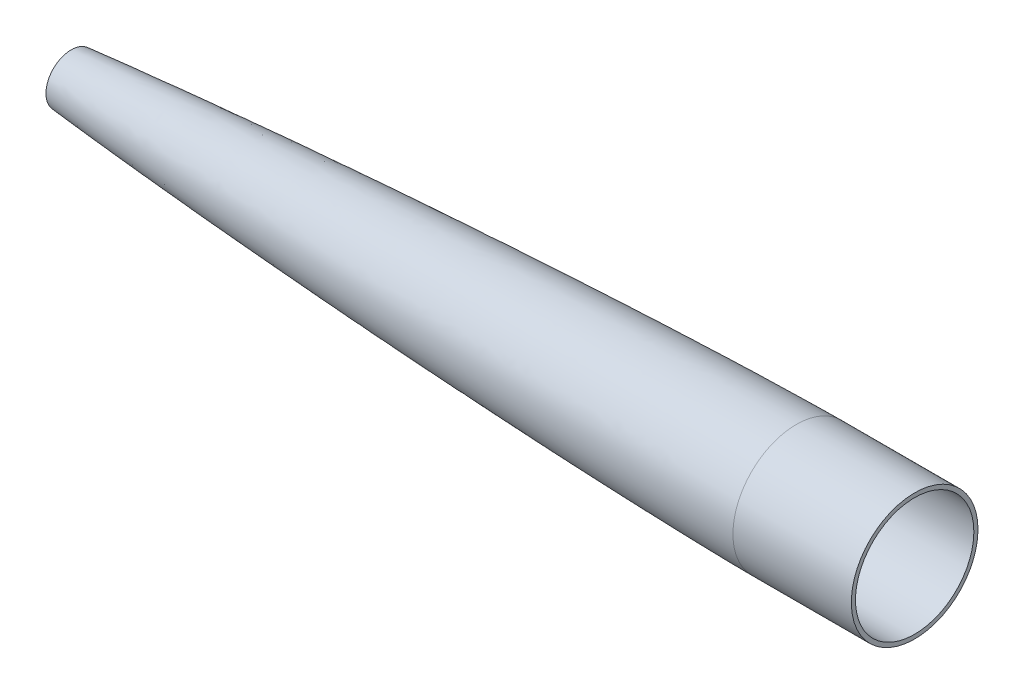
ISO-10303-21;
HEADER;
FILE_DESCRIPTION(('STEP AP214'),'2;1');
FILE_NAME('part.step','',(''),(''),'','','');
FILE_SCHEMA(('AUTOMOTIVE_DESIGN { 1 0 10303 214 1 1 1 1 }'));
ENDSEC;
DATA;
#1=APPLICATION_CONTEXT('core data for automotive mechanical design processes');
#2=APPLICATION_PROTOCOL_DEFINITION('international standard','automotive_design',2000,#1);
#3=PRODUCT_CONTEXT('',#1,'mechanical');
#4=PRODUCT('Part','Part','',(#3));
#5=PRODUCT_RELATED_PRODUCT_CATEGORY('part','',(#4));
#6=PRODUCT_DEFINITION_FORMATION('','',#4);
#7=PRODUCT_DEFINITION_CONTEXT('part definition',#1,'design');
#8=PRODUCT_DEFINITION('design','',#6,#7);
#9=PRODUCT_DEFINITION_SHAPE('','',#8);
#10=(LENGTH_UNIT() NAMED_UNIT(*) SI_UNIT(.MILLI.,.METRE.));
#11=(NAMED_UNIT(*) PLANE_ANGLE_UNIT() SI_UNIT($,.RADIAN.));
#12=(NAMED_UNIT(*) SI_UNIT($,.STERADIAN.) SOLID_ANGLE_UNIT());
#13=UNCERTAINTY_MEASURE_WITH_UNIT(LENGTH_MEASURE(1.E-05),#10,'distance_accuracy_value','');
#14=(GEOMETRIC_REPRESENTATION_CONTEXT(3) GLOBAL_UNCERTAINTY_ASSIGNED_CONTEXT((#13)) GLOBAL_UNIT_ASSIGNED_CONTEXT((#10,
#11,#12)) REPRESENTATION_CONTEXT('',''));
#15=CARTESIAN_POINT('',(0.,0.,0.));
#16=DIRECTION('',(0.,0.,1.));
#17=DIRECTION('',(1.,0.,0.));
#18=AXIS2_PLACEMENT_3D('',#15,#16,#17);
#19=CARTESIAN_POINT('',(69.85,0.,0.));
#20=DIRECTION('',(1.,0.,0.));
#21=DIRECTION('',(0.,0.,-1.));
#22=AXIS2_PLACEMENT_3D('',#19,#20,#21);
#23=PLANE('',#22);
#24=CARTESIAN_POINT('',(69.85,0.,0.));
#25=DIRECTION('',(1.,0.,0.));
#26=DIRECTION('',(0.,0.,-1.));
#27=AXIS2_PLACEMENT_3D('',#24,#25,#26);
#28=CIRCLE('',#27,10.790091691027);
#29=CARTESIAN_POINT('',(69.85,0.,-10.790091691027));
#30=VERTEX_POINT('',#29);
#31=EDGE_CURVE('E44',#30,#30,#28,.F.);
#32=ORIENTED_EDGE('',*,*,#31,.T.);
#33=EDGE_LOOP('',(#32));
#34=FACE_BOUND('',#33,.T.);
#35=CARTESIAN_POINT('',(69.85,0.,0.));
#36=DIRECTION('',(1.,0.,0.));
#37=DIRECTION('',(0.,0.,-1.));
#38=AXIS2_PLACEMENT_3D('',#35,#36,#37);
#39=CIRCLE('',#38,9.00448554056386);
#40=CARTESIAN_POINT('',(69.85,0.,-9.00448554056386));
#41=VERTEX_POINT('',#40);
#42=EDGE_CURVE('E10',#41,#41,#39,.T.);
#43=ORIENTED_EDGE('',*,*,#42,.T.);
#44=EDGE_LOOP('',(#43));
#45=FACE_BOUND('',#44,.T.);
#46=ADVANCED_FACE('F41',(#34,#45),#23,.F.);
#47=CARTESIAN_POINT('',(431.8,27.178,0.));
#48=DIRECTION('',(1.,0.,0.));
#49=DIRECTION('',(0.,0.,-1.));
#50=AXIS2_PLACEMENT_3D('',#47,#48,#49);
#51=PLANE('',#50);
#52=CARTESIAN_POINT('',(431.8,0.,0.));
#53=DIRECTION('',(1.,0.,0.));
#54=DIRECTION('',(0.,0.,-1.));
#55=AXIS2_PLACEMENT_3D('',#52,#53,#54);
#56=CIRCLE('',#55,27.178);
#57=CARTESIAN_POINT('',(431.8,0.,-27.178));
#58=VERTEX_POINT('',#57);
#59=EDGE_CURVE('E62',#58,#58,#56,.T.);
#60=ORIENTED_EDGE('',*,*,#59,.T.);
#61=EDGE_LOOP('',(#60));
#62=FACE_BOUND('',#61,.T.);
#63=CARTESIAN_POINT('',(431.8,0.,0.));
#64=DIRECTION('',(1.,0.,0.));
#65=DIRECTION('',(0.,0.,-1.));
#66=AXIS2_PLACEMENT_3D('',#63,#64,#65);
#67=CIRCLE('',#66,25.4);
#68=CARTESIAN_POINT('',(431.8,0.,-25.4));
#69=VERTEX_POINT('',#68);
#70=EDGE_CURVE('E58',#69,#69,#67,.T.);
#71=ORIENTED_EDGE('',*,*,#70,.F.);
#72=EDGE_LOOP('',(#71));
#73=FACE_BOUND('',#72,.T.);
#74=ADVANCED_FACE('F99',(#62,#73),#51,.T.);
#75=CARTESIAN_POINT('',(0.,0.,0.));
#76=DIRECTION('',(1.,0.,0.));
#77=DIRECTION('',(0.,0.,-1.));
#78=AXIS2_PLACEMENT_3D('',#75,#76,#77);
#79=CYLINDRICAL_SURFACE('',#78,25.3999999999994);
#80=ORIENTED_EDGE('',*,*,#70,.T.);
#81=EDGE_LOOP('',(#80));
#82=FACE_BOUND('',#81,.T.);
#83=CARTESIAN_POINT('',(381.,0.,0.));
#84=DIRECTION('',(1.,0.,0.));
#85=DIRECTION('',(0.,0.,-1.));
#86=AXIS2_PLACEMENT_3D('',#83,#84,#85);
#87=CIRCLE('',#86,25.3999999999988);
#88=CARTESIAN_POINT('',(381.,0.,-25.3999999999988));
#89=VERTEX_POINT('',#88);
#90=EDGE_CURVE('E53',#89,#89,#87,.T.);
#91=ORIENTED_EDGE('',*,*,#90,.F.);
#92=EDGE_LOOP('',(#91));
#93=FACE_BOUND('',#92,.T.);
#94=ADVANCED_FACE('F85',(#82,#93),#79,.F.);
#95=CARTESIAN_POINT('',(0.,0.,0.));
#96=CARTESIAN_POINT('',(0.00194131898105818,0.00324382281850564,0.));
#97=CARTESIAN_POINT('',(0.00638281843150003,0.00925201999437129,0.));
#98=CARTESIAN_POINT('',(0.0176672752625426,0.0192233607682896,0.));
#99=CARTESIAN_POINT('',(0.0422478322445727,0.0364888910073664,0.));
#100=CARTESIAN_POINT('',(0.0778590566848216,0.0572991083297123,0.));
#101=CARTESIAN_POINT('',(0.124666911094848,0.0810733879238252,0.));
#102=CARTESIAN_POINT('',(0.191190014980627,0.11156045619024,0.));
#103=CARTESIAN_POINT('',(0.270954305926508,0.144743138211191,0.));
#104=CARTESIAN_POINT('',(0.391141945765483,0.190791694328903,0.));
#105=CARTESIAN_POINT('',(0.570606758990353,0.253268093039603,0.));
#106=CARTESIAN_POINT('',(0.832648692772347,0.33633941228013,0.));
#107=CARTESIAN_POINT('',(1.26014846589056,0.459216901555793,0.));
#108=CARTESIAN_POINT('',(1.98312673069684,0.646181325770254,0.));
#109=CARTESIAN_POINT('',(3.28077516887983,0.943940875502552,0.));
#110=CARTESIAN_POINT('',(5.70508086499063,1.4307397776682,0.));
#111=CARTESIAN_POINT('',(10.2742825737692,2.22323289581667,0.));
#112=CARTESIAN_POINT('',(18.4903077036349,3.44274483447275,0.));
#113=CARTESIAN_POINT('',(31.8400399259184,5.13749675406155,0.));
#114=CARTESIAN_POINT('',(49.7469427778201,7.09950102046166,0.));
#115=CARTESIAN_POINT('',(71.1097711250029,9.16784910899345,0.));
#116=CARTESIAN_POINT('',(94.2685783470617,11.1850610547893,0.));
#117=CARTESIAN_POINT('',(117.441592145373,13.0306324072501,0.));
#118=CARTESIAN_POINT('',(140.625521947097,14.7330956752361,0.));
#119=CARTESIAN_POINT('',(163.818284683025,16.3102193474966,0.));
#120=CARTESIAN_POINT('',(187.01853645188,17.7729018299655,0.));
#121=CARTESIAN_POINT('',(210.225327067841,19.1276941212975,0.));
#122=CARTESIAN_POINT('',(239.241159915056,20.6903457255613,0.));
#123=CARTESIAN_POINT('',(268.265978315361,22.0787165522422,0.));
#124=CARTESIAN_POINT('',(297.298940403729,23.2863452136982,0.));
#125=CARTESIAN_POINT('',(326.339718466285,24.2852703157084,0.));
#126=CARTESIAN_POINT('',(346.242146301039,24.8430907377871,0.));
#127=CARTESIAN_POINT('',(362.8124479343,25.1993234300695,0.));
#128=CARTESIAN_POINT('',(373.573868338556,25.3501374288494,0.));
#129=CARTESIAN_POINT('',(378.5245713548,25.3941892108048,0.));
#130=CARTESIAN_POINT('',(381.,25.3999999999988,0.));
#131=B_SPLINE_CURVE_WITH_KNOTS('',4,(#95,#96,#97,#98,#99,#100,#101,#102,#103,#104,#105,#106,
#107,#108,#109,#110,#111,#112,#113,#114,#115,#116,#117,#118,#119,#120,#121,#122,#123,#124,#125,
#126,#127,#128,#129,#130),.UNSPECIFIED.,.F.,.F.,(5,1,1,1,1,1,1,1,1,1,1,1,1,1,1,1,1,1,1,1,1,1,1,
1,1,1,1,1,1,1,1,1,5),(0.,3.92274418332109E-05,7.84548836664218E-05,0.000156909767332844,
0.000313819534665687,0.000470729301998531,0.000627639069331374,0.000922762203045887,
0.0012178853367604,0.00181774938133708,0.0026163714155737,0.00379972338098714,
0.00587319568601147,0.00963320507640004,0.0165501838631131,0.0296785168897461,
0.0544081433048775,0.0965653336008319,0.157394907351711,0.21822448093177,0.279054054341046,
0.339883627752748,0.400713201179416,0.461542774610229,0.522372348031995,0.583201921587106,
0.644031495319072,0.765690642658022,0.826520216252702,0.887349789782304,0.948179363224984,
0.974089681612492,1.),.UNSPECIFIED.);
#132=CARTESIAN_POINT('',(0.,0.,0.));
#133=DIRECTION('',(1.,0.,0.));
#134=AXIS1_PLACEMENT('',#132,#133);
#135=SURFACE_OF_REVOLUTION('',#131,#134);
#136=ORIENTED_EDGE('',*,*,#42,.F.);
#137=EDGE_LOOP('',(#136));
#138=FACE_BOUND('',#137,.T.);
#139=ORIENTED_EDGE('',*,*,#90,.T.);
#140=EDGE_LOOP('',(#139));
#141=FACE_BOUND('',#140,.T.);
#142=ADVANCED_FACE('F81',(#138,#141),#135,.F.);
#143=CARTESIAN_POINT('',(0.,0.,0.));
#144=DIRECTION('',(1.,0.,0.));
#145=DIRECTION('',(0.,0.,-1.));
#146=AXIS2_PLACEMENT_3D('',#143,#144,#145);
#147=CYLINDRICAL_SURFACE('',#146,27.178002449278);
#148=CARTESIAN_POINT('',(380.999999988501,0.,0.));
#149=DIRECTION('',(1.,0.,0.));
#150=DIRECTION('',(0.,0.,-1.));
#151=AXIS2_PLACEMENT_3D('',#148,#149,#150);
#152=CIRCLE('',#151,27.178004898556);
#153=CARTESIAN_POINT('',(380.999999988501,0.,-27.178004898556));
#154=VERTEX_POINT('',#153);
#155=EDGE_CURVE('E66',#154,#154,#152,.T.);
#156=ORIENTED_EDGE('',*,*,#155,.T.);
#157=EDGE_LOOP('',(#156));
#158=FACE_BOUND('',#157,.T.);
#159=ORIENTED_EDGE('',*,*,#59,.F.);
#160=EDGE_LOOP('',(#159));
#161=FACE_BOUND('',#160,.T.);
#162=ADVANCED_FACE('F84',(#158,#161),#147,.T.);
#163=CARTESIAN_POINT('',(380.999999988501,27.178004898556,0.));
#164=CARTESIAN_POINT('',(377.011809395688,27.1686430715265,0.));
#165=CARTESIAN_POINT('',(369.032405494304,27.0705418334313,0.));
#166=CARTESIAN_POINT('',(353.102253462572,26.7817081544563,0.));
#167=CARTESIAN_POINT('',(325.227005898458,26.0608022190696,0.));
#168=CARTESIAN_POINT('',(285.42893389145,24.62938235712,0.));
#169=CARTESIAN_POINT('',(245.648268631064,22.7946100577036,0.));
#170=CARTESIAN_POINT('',(213.835604446446,21.1063621760341,0.));
#171=CARTESIAN_POINT('',(189.982086047048,19.7295721328265,0.));
#172=CARTESIAN_POINT('',(166.135030995834,18.239390463876,0.));
#173=CARTESIAN_POINT('',(142.295120906711,16.6290249178667,0.));
#174=CARTESIAN_POINT('',(122.435308371371,15.1774641542674,0.));
#175=CARTESIAN_POINT('',(106.552294621358,13.9407889834154,0.));
#176=CARTESIAN_POINT('',(94.6427428581862,12.9720266461959,0.));
#177=CARTESIAN_POINT('',(82.7361966804653,11.9574719627855,0.));
#178=CARTESIAN_POINT('',(70.8331276635155,10.8910657683593,0.));
#179=CARTESIAN_POINT('',(58.9340811263974,9.76403268724074,0.));
#180=CARTESIAN_POINT('',(49.0222976002812,8.76453144076448,0.));
#181=CARTESIAN_POINT('',(41.0956848826757,7.91841130343187,0.));
#182=CARTESIAN_POINT('',(35.1524843577158,7.25651083837625,0.));
#183=CARTESIAN_POINT('',(29.2112459863018,6.56286237235522,0.));
#184=CARTESIAN_POINT('',(24.2616189283935,5.95184653179457,0.));
#185=CARTESIAN_POINT('',(20.3030741712403,5.43690622250441,0.));
#186=CARTESIAN_POINT('',(17.3348916021154,5.03568218183608,0.));
#187=CARTESIAN_POINT('',(14.3668350236541,4.61641288285476,0.));
#188=CARTESIAN_POINT('',(11.8932899794198,4.24775930340232,0.));
#189=CARTESIAN_POINT('',(9.91452384763774,3.93782196118865,0.));
#190=CARTESIAN_POINT('',(8.43007743133958,3.69662833331625,0.));
#191=CARTESIAN_POINT('',(6.94450196646099,3.44458097768983,0.));
#192=CARTESIAN_POINT('',(5.45767713489601,3.17869526556295,0.));
#193=CARTESIAN_POINT('',(4.21653760602396,2.94238306433481,0.));
#194=CARTESIAN_POINT('',(3.21985506240756,2.73985389076108,0.));
#195=CARTESIAN_POINT('',(2.4702147944148,2.57955094894952,0.));
#196=CARTESIAN_POINT('',(1.84085356705133,2.43617177271658,0.));
#197=CARTESIAN_POINT('',(1.33304014934579,2.31279307566596,0.));
#198=CARTESIAN_POINT('',(0.947815906514998,2.21427401625679,0.));
#199=CARTESIAN_POINT('',(0.621686037371109,2.12541736877198,0.));
#200=CARTESIAN_POINT('',(0.354249916683707,2.04768017285842,0.));
#201=CARTESIAN_POINT('',(0.148530937148227,1.98471170786255,0.));
#202=CARTESIAN_POINT('',(-0.0293410694845988,1.92671381729612,0.));
#203=CARTESIAN_POINT('',(-0.179928296731225,1.8742748467517,0.));
#204=CARTESIAN_POINT('',(-0.298594066625534,1.83073451456745,0.));
#205=CARTESIAN_POINT('',(-0.405486420304997,1.78896203323619,0.));
#206=CARTESIAN_POINT('',(-0.500498327345184,1.74924153216943,0.));
#207=CARTESIAN_POINT('',(-0.578364938024124,1.71490473942585,0.));
#208=CARTESIAN_POINT('',(-0.652016516684189,1.68034404966892,0.));
#209=CARTESIAN_POINT('',(-0.721859780181899,1.64515495252197,0.));
#210=CARTESIAN_POINT('',(-0.780983825810091,1.61384382896837,0.));
#211=CARTESIAN_POINT('',(-0.855362465274258,1.57140786251089,0.));
#212=CARTESIAN_POINT('',(-0.925784029448303,1.52815317395989,0.));
#213=CARTESIAN_POINT('',(-1.01349324918468,1.46821434519424,0.));
#214=CARTESIAN_POINT('',(-1.08742939840569,1.4121997620924,0.));
#215=CARTESIAN_POINT('',(-1.26377196048408,1.26990480400537,0.));
#216=CARTESIAN_POINT('',(-1.45686145303945,1.02800000603678,0.));
#217=CARTESIAN_POINT('',(-1.52565368715093,0.913052477617118,0.));
#218=B_SPLINE_CURVE_WITH_KNOTS('',3,(#163,#164,#165,#166,#167,#168,#169,#170,#171,#172,#173,
#174,#175,#176,#177,#178,#179,#180,#181,#182,#183,#184,#185,#186,#187,#188,#189,#190,#191,#192,
#193,#194,#195,#196,#197,#198,#199,#200,#201,#202,#203,#204,#205,#206,#207,#208,#209,#210,#211,
#212,#213,#214,#215,#216,#217),.UNSPECIFIED.,.F.,.F.,(4,1,1,1,1,1,1,1,1,1,1,1,1,1,1,1,1,1,1,1,1,
1,1,1,1,1,1,1,1,1,1,1,1,1,1,1,1,1,1,1,1,1,1,1,1,1,1,1,1,1,1,1,4),(0.,0.0312503412922601,
0.0625006825845202,0.12500136516904,0.250002730338081,0.375004095507121,0.437504778091642,
0.500005460676162,0.562506143260682,0.625006825845202,0.687507508429723,0.718757849721983,
0.750008191014243,0.781258532306503,0.812508873598763,0.843759214891023,0.875009556183283,
0.890634726829413,0.906259897475543,0.921885068121673,0.937510238767804,0.945322824090869,
0.953135409413934,0.960947994736999,0.968760580060064,0.972666872721596,0.976573165383129,
0.980479458044661,0.984385750706194,0.988292043367726,0.990245189698493,0.992198336029259,
0.994151482360025,0.995128055525408,0.996104628690791,0.997081201856174,0.997569488438866,
0.998057775021558,0.998546061604249,0.998790204895595,0.999034348186941,0.999278491478287,
0.999400563123959,0.999522634769632,0.999644706415305,0.999705742238142,0.999766778060978,
0.999827813883814,0.999888849706651,0.999919367618069,0.999949885529487,0.999980403440906,
1.00001092135232),.UNSPECIFIED.);
#219=CARTESIAN_POINT('',(0.,0.,0.));
#220=DIRECTION('',(1.,0.,0.));
#221=AXIS1_PLACEMENT('',#219,#220);
#222=SURFACE_OF_REVOLUTION('',#218,#221);
#223=ORIENTED_EDGE('',*,*,#31,.F.);
#224=EDGE_LOOP('',(#223));
#225=FACE_BOUND('',#224,.T.);
#226=ORIENTED_EDGE('',*,*,#155,.F.);
#227=EDGE_LOOP('',(#226));
#228=FACE_BOUND('',#227,.T.);
#229=ADVANCED_FACE('F88',(#225,#228),#222,.F.);
#230=CLOSED_SHELL('',(#46,#74,#94,#142,#162,#229));
#231=MANIFOLD_SOLID_BREP('B2',#230);
#232=ADVANCED_BREP_SHAPE_REPRESENTATION('',(#18,#231),#14);
#233=SHAPE_DEFINITION_REPRESENTATION(#9,#232);
ENDSEC;
END-ISO-10303-21;
